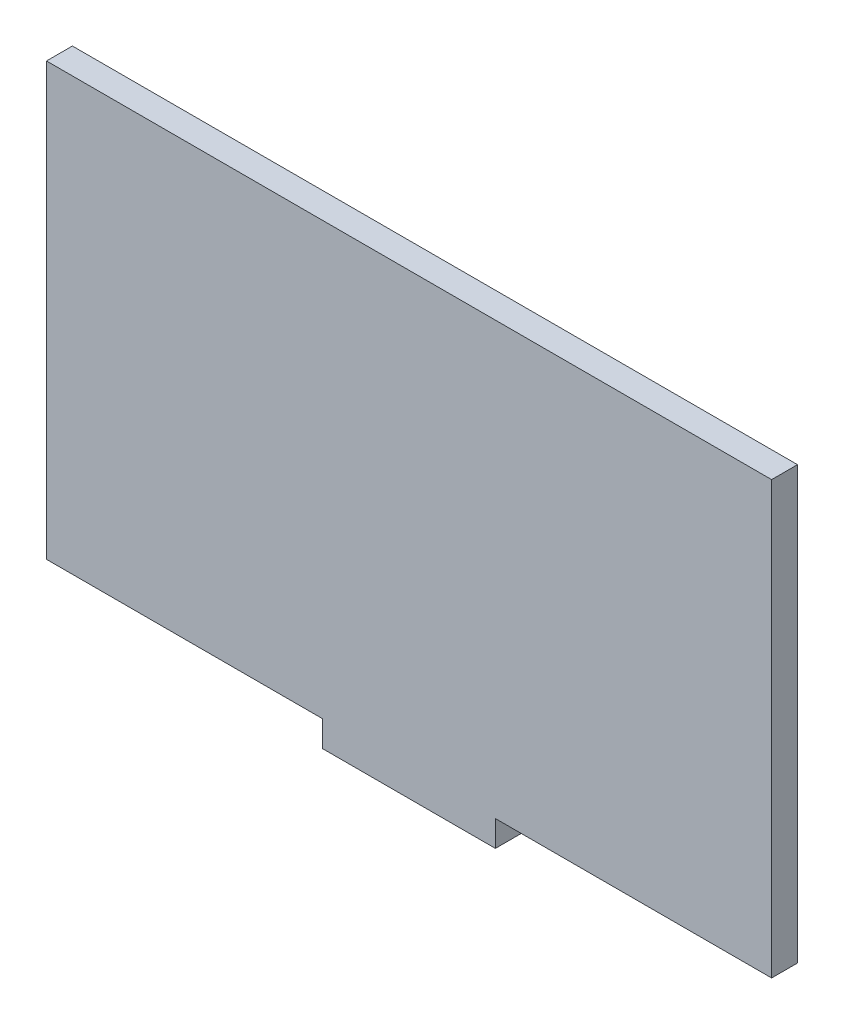
ISO-10303-21;
HEADER;
FILE_DESCRIPTION(('STEP AP214'),'2;1');
FILE_NAME('part.step','',(''),(''),'','','');
FILE_SCHEMA(('AUTOMOTIVE_DESIGN { 1 0 10303 214 1 1 1 1 }'));
ENDSEC;
DATA;
#1=APPLICATION_CONTEXT('core data for automotive mechanical design processes');
#2=APPLICATION_PROTOCOL_DEFINITION('international standard','automotive_design',2000,#1);
#3=PRODUCT_CONTEXT('',#1,'mechanical');
#4=PRODUCT('Part','Part','',(#3));
#5=PRODUCT_RELATED_PRODUCT_CATEGORY('part','',(#4));
#6=PRODUCT_DEFINITION_FORMATION('','',#4);
#7=PRODUCT_DEFINITION_CONTEXT('part definition',#1,'design');
#8=PRODUCT_DEFINITION('design','',#6,#7);
#9=PRODUCT_DEFINITION_SHAPE('','',#8);
#10=(LENGTH_UNIT() NAMED_UNIT(*) SI_UNIT(.MILLI.,.METRE.));
#11=(NAMED_UNIT(*) PLANE_ANGLE_UNIT() SI_UNIT($,.RADIAN.));
#12=(NAMED_UNIT(*) SI_UNIT($,.STERADIAN.) SOLID_ANGLE_UNIT());
#13=UNCERTAINTY_MEASURE_WITH_UNIT(LENGTH_MEASURE(1.E-05),#10,'distance_accuracy_value','');
#14=(GEOMETRIC_REPRESENTATION_CONTEXT(3) GLOBAL_UNCERTAINTY_ASSIGNED_CONTEXT((#13)) GLOBAL_UNIT_ASSIGNED_CONTEXT((#10,
#11,#12)) REPRESENTATION_CONTEXT('',''));
#15=CARTESIAN_POINT('',(0.,0.,0.));
#16=DIRECTION('',(0.,0.,1.));
#17=DIRECTION('',(1.,0.,0.));
#18=AXIS2_PLACEMENT_3D('',#15,#16,#17);
#19=CARTESIAN_POINT('',(-42.,-25.,3.));
#20=DIRECTION('',(0.,1.,0.));
#21=DIRECTION('',(0.,0.,1.));
#22=AXIS2_PLACEMENT_3D('',#19,#20,#21);
#23=PLANE('',#22);
#24=DIRECTION('',(0.,0.,1.));
#25=VECTOR('',#24,1.);
#26=CARTESIAN_POINT('',(10.,-25.,0.));
#27=LINE('',#26,#25);
#28=CARTESIAN_POINT('',(10.,-25.,0.));
#29=VERTEX_POINT('',#28);
#30=CARTESIAN_POINT('',(10.,-25.,3.));
#31=VERTEX_POINT('',#30);
#32=EDGE_CURVE('E157',#29,#31,#27,.T.);
#33=ORIENTED_EDGE('',*,*,#32,.F.);
#34=DIRECTION('',(1.,0.,0.));
#35=VECTOR('',#34,1.);
#36=CARTESIAN_POINT('',(-42.,-25.,0.));
#37=LINE('',#36,#35);
#38=CARTESIAN_POINT('',(42.,-25.,0.));
#39=VERTEX_POINT('',#38);
#40=EDGE_CURVE('E90',#29,#39,#37,.T.);
#41=ORIENTED_EDGE('',*,*,#40,.T.);
#42=DIRECTION('',(0.,0.,-1.));
#43=VECTOR('',#42,1.);
#44=CARTESIAN_POINT('',(42.,-25.,3.));
#45=LINE('',#44,#43);
#46=CARTESIAN_POINT('',(42.,-25.,3.));
#47=VERTEX_POINT('',#46);
#48=EDGE_CURVE('E175',#47,#39,#45,.T.);
#49=ORIENTED_EDGE('',*,*,#48,.F.);
#50=DIRECTION('',(1.,0.,0.));
#51=VECTOR('',#50,1.);
#52=CARTESIAN_POINT('',(-42.,-25.,3.));
#53=LINE('',#52,#51);
#54=EDGE_CURVE('E68',#31,#47,#53,.T.);
#55=ORIENTED_EDGE('',*,*,#54,.F.);
#56=EDGE_LOOP('',(#33,#41,#49,#55));
#57=FACE_BOUND('',#56,.T.);
#58=ADVANCED_FACE('F43',(#57),#23,.F.);
#59=CARTESIAN_POINT('',(42.,25.,3.));
#60=DIRECTION('',(-1.,0.,0.));
#61=DIRECTION('',(0.,0.,1.));
#62=AXIS2_PLACEMENT_3D('',#59,#60,#61);
#63=PLANE('',#62);
#64=DIRECTION('',(0.,1.,0.));
#65=VECTOR('',#64,1.);
#66=CARTESIAN_POINT('',(42.,25.,0.));
#67=LINE('',#66,#65);
#68=CARTESIAN_POINT('',(42.,25.,0.));
#69=VERTEX_POINT('',#68);
#70=EDGE_CURVE('E156',#39,#69,#67,.T.);
#71=ORIENTED_EDGE('',*,*,#70,.T.);
#72=DIRECTION('',(0.,0.,-1.));
#73=VECTOR('',#72,1.);
#74=CARTESIAN_POINT('',(42.,25.,3.));
#75=LINE('',#74,#73);
#76=CARTESIAN_POINT('',(42.,25.,3.));
#77=VERTEX_POINT('',#76);
#78=EDGE_CURVE('E11',#77,#69,#75,.T.);
#79=ORIENTED_EDGE('',*,*,#78,.F.);
#80=DIRECTION('',(0.,1.,0.));
#81=VECTOR('',#80,1.);
#82=CARTESIAN_POINT('',(42.,25.,3.));
#83=LINE('',#82,#81);
#84=EDGE_CURVE('E162',#47,#77,#83,.T.);
#85=ORIENTED_EDGE('',*,*,#84,.F.);
#86=ORIENTED_EDGE('',*,*,#48,.T.);
#87=EDGE_LOOP('',(#71,#79,#85,#86));
#88=FACE_BOUND('',#87,.T.);
#89=ADVANCED_FACE('F45',(#88),#63,.F.);
#90=CARTESIAN_POINT('',(-42.,25.,3.));
#91=DIRECTION('',(0.,-1.,0.));
#92=DIRECTION('',(0.,0.,-1.));
#93=AXIS2_PLACEMENT_3D('',#90,#91,#92);
#94=PLANE('',#93);
#95=DIRECTION('',(-1.,0.,0.));
#96=VECTOR('',#95,1.);
#97=CARTESIAN_POINT('',(-42.,25.,0.));
#98=LINE('',#97,#96);
#99=CARTESIAN_POINT('',(-42.,25.,0.));
#100=VERTEX_POINT('',#99);
#101=EDGE_CURVE('E179',#69,#100,#98,.T.);
#102=ORIENTED_EDGE('',*,*,#101,.T.);
#103=DIRECTION('',(0.,0.,-1.));
#104=VECTOR('',#103,1.);
#105=CARTESIAN_POINT('',(-42.,25.,3.));
#106=LINE('',#105,#104);
#107=CARTESIAN_POINT('',(-42.,25.,3.));
#108=VERTEX_POINT('',#107);
#109=EDGE_CURVE('E52',#108,#100,#106,.T.);
#110=ORIENTED_EDGE('',*,*,#109,.F.);
#111=DIRECTION('',(-1.,0.,0.));
#112=VECTOR('',#111,1.);
#113=CARTESIAN_POINT('',(-42.,25.,3.));
#114=LINE('',#113,#112);
#115=EDGE_CURVE('E97',#77,#108,#114,.T.);
#116=ORIENTED_EDGE('',*,*,#115,.F.);
#117=ORIENTED_EDGE('',*,*,#78,.T.);
#118=EDGE_LOOP('',(#102,#110,#116,#117));
#119=FACE_BOUND('',#118,.T.);
#120=ADVANCED_FACE('F206',(#119),#94,.F.);
#121=CARTESIAN_POINT('',(-42.,25.,3.));
#122=DIRECTION('',(1.,0.,0.));
#123=DIRECTION('',(0.,0.,-1.));
#124=AXIS2_PLACEMENT_3D('',#121,#122,#123);
#125=PLANE('',#124);
#126=DIRECTION('',(0.,-1.,0.));
#127=VECTOR('',#126,1.);
#128=CARTESIAN_POINT('',(-42.,25.,0.));
#129=LINE('',#128,#127);
#130=CARTESIAN_POINT('',(-42.,-25.,0.));
#131=VERTEX_POINT('',#130);
#132=EDGE_CURVE('E182',#100,#131,#129,.T.);
#133=ORIENTED_EDGE('',*,*,#132,.T.);
#134=DIRECTION('',(0.,0.,-1.));
#135=VECTOR('',#134,1.);
#136=CARTESIAN_POINT('',(-42.,-25.,3.));
#137=LINE('',#136,#135);
#138=CARTESIAN_POINT('',(-42.,-25.,3.));
#139=VERTEX_POINT('',#138);
#140=EDGE_CURVE('E189',#139,#131,#137,.T.);
#141=ORIENTED_EDGE('',*,*,#140,.F.);
#142=DIRECTION('',(0.,-1.,0.));
#143=VECTOR('',#142,1.);
#144=CARTESIAN_POINT('',(-42.,25.,3.));
#145=LINE('',#144,#143);
#146=EDGE_CURVE('E168',#108,#139,#145,.T.);
#147=ORIENTED_EDGE('',*,*,#146,.F.);
#148=ORIENTED_EDGE('',*,*,#109,.T.);
#149=EDGE_LOOP('',(#133,#141,#147,#148));
#150=FACE_BOUND('',#149,.T.);
#151=ADVANCED_FACE('F197',(#150),#125,.F.);
#152=CARTESIAN_POINT('',(-9.99999999999999,-25.,0.));
#153=VERTEX_POINT('',#152);
#154=EDGE_CURVE('E165',#131,#153,#37,.T.);
#155=ORIENTED_EDGE('',*,*,#154,.T.);
#156=DIRECTION('',(0.,0.,1.));
#157=VECTOR('',#156,1.);
#158=CARTESIAN_POINT('',(-9.99999999999999,-25.,0.));
#159=LINE('',#158,#157);
#160=CARTESIAN_POINT('',(-10.,-25.,3.));
#161=VERTEX_POINT('',#160);
#162=EDGE_CURVE('E141',#153,#161,#159,.T.);
#163=ORIENTED_EDGE('',*,*,#162,.T.);
#164=EDGE_CURVE('E171',#139,#161,#53,.T.);
#165=ORIENTED_EDGE('',*,*,#164,.F.);
#166=ORIENTED_EDGE('',*,*,#140,.T.);
#167=EDGE_LOOP('',(#155,#163,#165,#166));
#168=FACE_BOUND('',#167,.T.);
#169=ADVANCED_FACE('F200',(#168),#23,.F.);
#170=CARTESIAN_POINT('',(0.,0.,3.));
#171=DIRECTION('',(0.,0.,1.));
#172=DIRECTION('',(1.,0.,0.));
#173=AXIS2_PLACEMENT_3D('',#170,#171,#172);
#174=PLANE('',#173);
#175=ORIENTED_EDGE('',*,*,#84,.T.);
#176=ORIENTED_EDGE('',*,*,#115,.T.);
#177=ORIENTED_EDGE('',*,*,#146,.T.);
#178=ORIENTED_EDGE('',*,*,#164,.T.);
#179=DIRECTION('',(0.,-1.,0.));
#180=VECTOR('',#179,1.);
#181=CARTESIAN_POINT('',(-9.99999999999999,-25.,3.));
#182=LINE('',#181,#180);
#183=CARTESIAN_POINT('',(-10.,-28.,3.));
#184=VERTEX_POINT('',#183);
#185=EDGE_CURVE('E59',#161,#184,#182,.T.);
#186=ORIENTED_EDGE('',*,*,#185,.T.);
#187=DIRECTION('',(1.,0.,0.));
#188=VECTOR('',#187,1.);
#189=CARTESIAN_POINT('',(-10.,-28.,3.));
#190=LINE('',#189,#188);
#191=CARTESIAN_POINT('',(10.,-28.,3.));
#192=VERTEX_POINT('',#191);
#193=EDGE_CURVE('E124',#184,#192,#190,.T.);
#194=ORIENTED_EDGE('',*,*,#193,.T.);
#195=DIRECTION('',(0.,1.,0.));
#196=VECTOR('',#195,1.);
#197=CARTESIAN_POINT('',(10.,-25.,3.));
#198=LINE('',#197,#196);
#199=EDGE_CURVE('E143',#192,#31,#198,.T.);
#200=ORIENTED_EDGE('',*,*,#199,.T.);
#201=ORIENTED_EDGE('',*,*,#54,.T.);
#202=EDGE_LOOP('',(#175,#176,#177,#178,#186,#194,#200,#201));
#203=FACE_BOUND('',#202,.T.);
#204=ADVANCED_FACE('F202',(#203),#174,.T.);
#205=CARTESIAN_POINT('',(0.,0.,0.));
#206=DIRECTION('',(0.,0.,1.));
#207=DIRECTION('',(1.,0.,0.));
#208=AXIS2_PLACEMENT_3D('',#205,#206,#207);
#209=PLANE('',#208);
#210=ORIENTED_EDGE('',*,*,#70,.F.);
#211=ORIENTED_EDGE('',*,*,#40,.F.);
#212=DIRECTION('',(0.,1.,0.));
#213=VECTOR('',#212,1.);
#214=CARTESIAN_POINT('',(10.,-25.,0.));
#215=LINE('',#214,#213);
#216=CARTESIAN_POINT('',(10.,-28.,0.));
#217=VERTEX_POINT('',#216);
#218=EDGE_CURVE('E128',#217,#29,#215,.T.);
#219=ORIENTED_EDGE('',*,*,#218,.F.);
#220=DIRECTION('',(1.,0.,0.));
#221=VECTOR('',#220,1.);
#222=CARTESIAN_POINT('',(-10.,-28.,0.));
#223=LINE('',#222,#221);
#224=CARTESIAN_POINT('',(-10.,-28.,0.));
#225=VERTEX_POINT('',#224);
#226=EDGE_CURVE('E122',#225,#217,#223,.T.);
#227=ORIENTED_EDGE('',*,*,#226,.F.);
#228=DIRECTION('',(0.,-1.,0.));
#229=VECTOR('',#228,1.);
#230=CARTESIAN_POINT('',(-9.99999999999999,-25.,0.));
#231=LINE('',#230,#229);
#232=EDGE_CURVE('E136',#153,#225,#231,.T.);
#233=ORIENTED_EDGE('',*,*,#232,.F.);
#234=ORIENTED_EDGE('',*,*,#154,.F.);
#235=ORIENTED_EDGE('',*,*,#132,.F.);
#236=ORIENTED_EDGE('',*,*,#101,.F.);
#237=EDGE_LOOP('',(#210,#211,#219,#227,#233,#234,#235,#236));
#238=FACE_BOUND('',#237,.T.);
#239=ADVANCED_FACE('F134',(#238),#209,.F.);
#240=CARTESIAN_POINT('',(-9.99999999999999,-25.,0.));
#241=DIRECTION('',(-1.,0.,0.));
#242=DIRECTION('',(0.,-1.,0.));
#243=AXIS2_PLACEMENT_3D('',#240,#241,#242);
#244=PLANE('',#243);
#245=ORIENTED_EDGE('',*,*,#185,.F.);
#246=ORIENTED_EDGE('',*,*,#162,.F.);
#247=ORIENTED_EDGE('',*,*,#232,.T.);
#248=DIRECTION('',(0.,0.,1.));
#249=VECTOR('',#248,1.);
#250=CARTESIAN_POINT('',(-10.,-28.,0.));
#251=LINE('',#250,#249);
#252=EDGE_CURVE('E119',#225,#184,#251,.T.);
#253=ORIENTED_EDGE('',*,*,#252,.T.);
#254=EDGE_LOOP('',(#245,#246,#247,#253));
#255=FACE_BOUND('',#254,.T.);
#256=ADVANCED_FACE('F140',(#255),#244,.T.);
#257=CARTESIAN_POINT('',(10.,-25.,0.));
#258=DIRECTION('',(1.,0.,0.));
#259=DIRECTION('',(0.,1.,0.));
#260=AXIS2_PLACEMENT_3D('',#257,#258,#259);
#261=PLANE('',#260);
#262=ORIENTED_EDGE('',*,*,#199,.F.);
#263=DIRECTION('',(0.,0.,1.));
#264=VECTOR('',#263,1.);
#265=CARTESIAN_POINT('',(10.,-28.,0.));
#266=LINE('',#265,#264);
#267=EDGE_CURVE('E127',#217,#192,#266,.T.);
#268=ORIENTED_EDGE('',*,*,#267,.F.);
#269=ORIENTED_EDGE('',*,*,#218,.T.);
#270=ORIENTED_EDGE('',*,*,#32,.T.);
#271=EDGE_LOOP('',(#262,#268,#269,#270));
#272=FACE_BOUND('',#271,.T.);
#273=ADVANCED_FACE('F229',(#272),#261,.T.);
#274=CARTESIAN_POINT('',(-10.,-28.,0.));
#275=DIRECTION('',(0.,-1.,0.));
#276=DIRECTION('',(0.,0.,-1.));
#277=AXIS2_PLACEMENT_3D('',#274,#275,#276);
#278=PLANE('',#277);
#279=ORIENTED_EDGE('',*,*,#193,.F.);
#280=ORIENTED_EDGE('',*,*,#252,.F.);
#281=ORIENTED_EDGE('',*,*,#226,.T.);
#282=ORIENTED_EDGE('',*,*,#267,.T.);
#283=EDGE_LOOP('',(#279,#280,#281,#282));
#284=FACE_BOUND('',#283,.T.);
#285=ADVANCED_FACE('F121',(#284),#278,.T.);
#286=CLOSED_SHELL('',(#58,#89,#120,#151,#169,#204,#239,#256,#273,#285));
#287=MANIFOLD_SOLID_BREP('B2',#286);
#288=ADVANCED_BREP_SHAPE_REPRESENTATION('',(#18,#287),#14);
#289=SHAPE_DEFINITION_REPRESENTATION(#9,#288);
ENDSEC;
END-ISO-10303-21;
